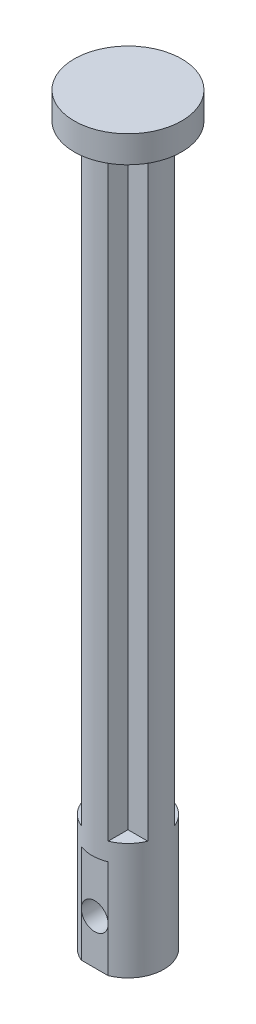
ISO-10303-21;
HEADER;
FILE_DESCRIPTION(('STEP AP214'),'2;1');
FILE_NAME('part.step','',(''),(''),'','','');
FILE_SCHEMA(('AUTOMOTIVE_DESIGN { 1 0 10303 214 1 1 1 1 }'));
ENDSEC;
DATA;
#1=APPLICATION_CONTEXT('core data for automotive mechanical design processes');
#2=APPLICATION_PROTOCOL_DEFINITION('international standard','automotive_design',2000,#1);
#3=PRODUCT_CONTEXT('',#1,'mechanical');
#4=PRODUCT('Part','Part','',(#3));
#5=PRODUCT_RELATED_PRODUCT_CATEGORY('part','',(#4));
#6=PRODUCT_DEFINITION_FORMATION('','',#4);
#7=PRODUCT_DEFINITION_CONTEXT('part definition',#1,'design');
#8=PRODUCT_DEFINITION('design','',#6,#7);
#9=PRODUCT_DEFINITION_SHAPE('','',#8);
#10=(LENGTH_UNIT() NAMED_UNIT(*) SI_UNIT(.MILLI.,.METRE.));
#11=(NAMED_UNIT(*) PLANE_ANGLE_UNIT() SI_UNIT($,.RADIAN.));
#12=(NAMED_UNIT(*) SI_UNIT($,.STERADIAN.) SOLID_ANGLE_UNIT());
#13=UNCERTAINTY_MEASURE_WITH_UNIT(LENGTH_MEASURE(1.E-05),#10,'distance_accuracy_value','');
#14=(GEOMETRIC_REPRESENTATION_CONTEXT(3) GLOBAL_UNCERTAINTY_ASSIGNED_CONTEXT((#13)) GLOBAL_UNIT_ASSIGNED_CONTEXT((#10,
#11,#12)) REPRESENTATION_CONTEXT('',''));
#15=CARTESIAN_POINT('',(0.,0.,0.));
#16=DIRECTION('',(0.,0.,1.));
#17=DIRECTION('',(1.,0.,0.));
#18=AXIS2_PLACEMENT_3D('',#15,#16,#17);
#19=CARTESIAN_POINT('',(-1.5,11.,3.70809924354783));
#20=DIRECTION('',(0.,0.,-1.));
#21=DIRECTION('',(-1.,0.,0.));
#22=AXIS2_PLACEMENT_3D('',#19,#20,#21);
#23=PLANE('',#22);
#24=DIRECTION('',(0.,-1.,0.));
#25=VECTOR('',#24,1.);
#26=CARTESIAN_POINT('',(-1.5,11.,3.70809924354783));
#27=LINE('',#26,#25);
#28=CARTESIAN_POINT('',(-1.5,11.,3.70809924354783));
#29=VERTEX_POINT('',#28);
#30=CARTESIAN_POINT('',(-1.5,5.,3.70809924354783));
#31=VERTEX_POINT('',#30);
#32=EDGE_CURVE('E193',#29,#31,#27,.T.);
#33=ORIENTED_EDGE('',*,*,#32,.T.);
#34=CARTESIAN_POINT('',(0.,5.,3.70809924354783));
#35=DIRECTION('',(0.,0.,1.));
#36=DIRECTION('',(1.,0.,0.));
#37=AXIS2_PLACEMENT_3D('',#34,#35,#36);
#38=CIRCLE('',#37,1.5);
#39=CARTESIAN_POINT('',(1.5,5.,3.70809924354783));
#40=VERTEX_POINT('',#39);
#41=EDGE_CURVE('E219',#40,#31,#38,.T.);
#42=ORIENTED_EDGE('',*,*,#41,.F.);
#43=DIRECTION('',(0.,-1.,0.));
#44=VECTOR('',#43,1.);
#45=CARTESIAN_POINT('',(1.5,11.,3.70809924354783));
#46=LINE('',#45,#44);
#47=CARTESIAN_POINT('',(1.5,11.,3.70809924354783));
#48=VERTEX_POINT('',#47);
#49=EDGE_CURVE('E197',#48,#40,#46,.T.);
#50=ORIENTED_EDGE('',*,*,#49,.F.);
#51=DIRECTION('',(1.,0.,0.));
#52=VECTOR('',#51,1.);
#53=CARTESIAN_POINT('',(-1.5,11.,3.70809924354783));
#54=LINE('',#53,#52);
#55=EDGE_CURVE('E212',#29,#48,#54,.T.);
#56=ORIENTED_EDGE('',*,*,#55,.F.);
#57=EDGE_LOOP('',(#33,#42,#50,#56));
#58=FACE_BOUND('',#57,.T.);
#59=ADVANCED_FACE('F43',(#58),#23,.F.);
#60=CARTESIAN_POINT('',(0.,80.,0.));
#61=DIRECTION('',(0.,-1.,0.));
#62=DIRECTION('',(0.,0.,-1.));
#63=AXIS2_PLACEMENT_3D('',#60,#61,#62);
#64=CYLINDRICAL_SURFACE('',#63,4.);
#65=CARTESIAN_POINT('',(0.,13.,0.));
#66=DIRECTION('',(0.,1.,0.));
#67=DIRECTION('',(0.,0.,1.));
#68=AXIS2_PLACEMENT_3D('',#65,#66,#67);
#69=CIRCLE('',#68,4.);
#70=CARTESIAN_POINT('',(-1.5,13.,-3.70809924354783));
#71=VERTEX_POINT('',#70);
#72=CARTESIAN_POINT('',(-3.70809924354783,13.,-1.5));
#73=VERTEX_POINT('',#72);
#74=EDGE_CURVE('E161',#71,#73,#69,.T.);
#75=ORIENTED_EDGE('',*,*,#74,.F.);
#76=DIRECTION('',(0.,1.,0.));
#77=VECTOR('',#76,1.);
#78=CARTESIAN_POINT('',(-1.5,13.,-3.70809924354783));
#79=LINE('',#78,#77);
#80=CARTESIAN_POINT('',(-1.5,80.,-3.70809924354783));
#81=VERTEX_POINT('',#80);
#82=EDGE_CURVE('E153',#71,#81,#79,.T.);
#83=ORIENTED_EDGE('',*,*,#82,.T.);
#84=CARTESIAN_POINT('',(0.,80.,0.));
#85=DIRECTION('',(0.,1.,0.));
#86=DIRECTION('',(0.,0.,1.));
#87=AXIS2_PLACEMENT_3D('',#84,#85,#86);
#88=CIRCLE('',#87,4.);
#89=CARTESIAN_POINT('',(1.5,80.,-3.70809924354783));
#90=VERTEX_POINT('',#89);
#91=EDGE_CURVE('E158',#90,#81,#88,.T.);
#92=ORIENTED_EDGE('',*,*,#91,.F.);
#93=DIRECTION('',(0.,1.,0.));
#94=VECTOR('',#93,1.);
#95=CARTESIAN_POINT('',(1.5,13.,-3.70809924354783));
#96=LINE('',#95,#94);
#97=CARTESIAN_POINT('',(1.5,13.,-3.70809924354783));
#98=VERTEX_POINT('',#97);
#99=EDGE_CURVE('E281',#98,#90,#96,.T.);
#100=ORIENTED_EDGE('',*,*,#99,.F.);
#101=CARTESIAN_POINT('',(0.,13.,0.));
#102=DIRECTION('',(0.,1.,0.));
#103=DIRECTION('',(0.,0.,1.));
#104=AXIS2_PLACEMENT_3D('',#101,#102,#103);
#105=CIRCLE('',#104,4.);
#106=CARTESIAN_POINT('',(3.70809924354783,13.,-1.5));
#107=VERTEX_POINT('',#106);
#108=EDGE_CURVE('E268',#107,#98,#105,.T.);
#109=ORIENTED_EDGE('',*,*,#108,.F.);
#110=DIRECTION('',(0.,1.,0.));
#111=VECTOR('',#110,1.);
#112=CARTESIAN_POINT('',(3.70809924354783,13.,-1.5));
#113=LINE('',#112,#111);
#114=CARTESIAN_POINT('',(3.70809924354783,80.,-1.5));
#115=VERTEX_POINT('',#114);
#116=EDGE_CURVE('E262',#107,#115,#113,.T.);
#117=ORIENTED_EDGE('',*,*,#116,.T.);
#118=CARTESIAN_POINT('',(3.70809924354783,80.,1.5));
#119=VERTEX_POINT('',#118);
#120=EDGE_CURVE('E52',#119,#115,#88,.T.);
#121=ORIENTED_EDGE('',*,*,#120,.F.);
#122=DIRECTION('',(0.,1.,0.));
#123=VECTOR('',#122,1.);
#124=CARTESIAN_POINT('',(3.70809924354783,13.,1.5));
#125=LINE('',#124,#123);
#126=CARTESIAN_POINT('',(3.70809924354783,13.,1.5));
#127=VERTEX_POINT('',#126);
#128=EDGE_CURVE('E308',#127,#119,#125,.T.);
#129=ORIENTED_EDGE('',*,*,#128,.F.);
#130=CARTESIAN_POINT('',(0.,13.,0.));
#131=DIRECTION('',(0.,1.,0.));
#132=DIRECTION('',(0.,0.,1.));
#133=AXIS2_PLACEMENT_3D('',#130,#131,#132);
#134=CIRCLE('',#133,4.);
#135=CARTESIAN_POINT('',(1.5,13.,3.70809924354783));
#136=VERTEX_POINT('',#135);
#137=EDGE_CURVE('E295',#136,#127,#134,.T.);
#138=ORIENTED_EDGE('',*,*,#137,.F.);
#139=DIRECTION('',(0.,1.,0.));
#140=VECTOR('',#139,1.);
#141=CARTESIAN_POINT('',(1.5,13.,3.70809924354783));
#142=LINE('',#141,#140);
#143=CARTESIAN_POINT('',(1.5,80.,3.70809924354783));
#144=VERTEX_POINT('',#143);
#145=EDGE_CURVE('E284',#136,#144,#142,.T.);
#146=ORIENTED_EDGE('',*,*,#145,.T.);
#147=CARTESIAN_POINT('',(-1.5,80.,3.70809924354783));
#148=VERTEX_POINT('',#147);
#149=EDGE_CURVE('E187',#148,#144,#88,.T.);
#150=ORIENTED_EDGE('',*,*,#149,.F.);
#151=DIRECTION('',(0.,1.,0.));
#152=VECTOR('',#151,1.);
#153=CARTESIAN_POINT('',(-1.5,13.,3.70809924354783));
#154=LINE('',#153,#152);
#155=CARTESIAN_POINT('',(-1.5,13.,3.70809924354783));
#156=VERTEX_POINT('',#155);
#157=EDGE_CURVE('E59',#156,#148,#154,.T.);
#158=ORIENTED_EDGE('',*,*,#157,.F.);
#159=CARTESIAN_POINT('',(0.,13.,0.));
#160=DIRECTION('',(0.,1.,0.));
#161=DIRECTION('',(0.,0.,1.));
#162=AXIS2_PLACEMENT_3D('',#159,#160,#161);
#163=CIRCLE('',#162,4.);
#164=CARTESIAN_POINT('',(-3.70809924354783,13.,1.5));
#165=VERTEX_POINT('',#164);
#166=EDGE_CURVE('E238',#165,#156,#163,.T.);
#167=ORIENTED_EDGE('',*,*,#166,.F.);
#168=DIRECTION('',(0.,1.,0.));
#169=VECTOR('',#168,1.);
#170=CARTESIAN_POINT('',(-3.70809924354783,13.,1.5));
#171=LINE('',#170,#169);
#172=CARTESIAN_POINT('',(-3.70809924354783,80.,1.5));
#173=VERTEX_POINT('',#172);
#174=EDGE_CURVE('E222',#165,#173,#171,.T.);
#175=ORIENTED_EDGE('',*,*,#174,.T.);
#176=CARTESIAN_POINT('',(-3.70809924354783,80.,-1.5));
#177=VERTEX_POINT('',#176);
#178=EDGE_CURVE('E182',#177,#173,#88,.T.);
#179=ORIENTED_EDGE('',*,*,#178,.F.);
#180=DIRECTION('',(0.,1.,0.));
#181=VECTOR('',#180,1.);
#182=CARTESIAN_POINT('',(-3.70809924354783,13.,-1.5));
#183=LINE('',#182,#181);
#184=EDGE_CURVE('E67',#73,#177,#183,.T.);
#185=ORIENTED_EDGE('',*,*,#184,.F.);
#186=EDGE_LOOP('',(#75,#83,#92,#100,#109,#117,#121,#129,#138,#146,#150,#158,#167,#175,#179,#185));
#187=FACE_BOUND('',#186,.T.);
#188=CARTESIAN_POINT('',(0.,11.,0.));
#189=DIRECTION('',(0.,-1.,0.));
#190=DIRECTION('',(0.,0.,-1.));
#191=AXIS2_PLACEMENT_3D('',#188,#189,#190);
#192=CIRCLE('',#191,4.);
#193=EDGE_CURVE('E210',#48,#29,#192,.T.);
#194=ORIENTED_EDGE('',*,*,#193,.F.);
#195=ORIENTED_EDGE('',*,*,#49,.T.);
#196=CARTESIAN_POINT('',(1.5,0.,3.70809924354783));
#197=VERTEX_POINT('',#196);
#198=EDGE_CURVE('E202',#40,#197,#46,.T.);
#199=ORIENTED_EDGE('',*,*,#198,.T.);
#200=CARTESIAN_POINT('',(0.,0.,0.));
#201=DIRECTION('',(0.,1.,0.));
#202=DIRECTION('',(0.,0.,1.));
#203=AXIS2_PLACEMENT_3D('',#200,#201,#202);
#204=CIRCLE('',#203,4.);
#205=CARTESIAN_POINT('',(-1.5,0.,3.70809924354783));
#206=VERTEX_POINT('',#205);
#207=EDGE_CURVE('E192',#197,#206,#204,.T.);
#208=ORIENTED_EDGE('',*,*,#207,.T.);
#209=EDGE_CURVE('E216',#31,#206,#27,.T.);
#210=ORIENTED_EDGE('',*,*,#209,.F.);
#211=ORIENTED_EDGE('',*,*,#32,.F.);
#212=EDGE_LOOP('',(#194,#195,#199,#208,#210,#211));
#213=FACE_BOUND('',#212,.T.);
#214=ADVANCED_FACE('F45',(#187,#213),#64,.T.);
#215=CARTESIAN_POINT('',(0.,0.,0.));
#216=DIRECTION('',(0.,1.,0.));
#217=DIRECTION('',(0.,0.,1.));
#218=AXIS2_PLACEMENT_3D('',#215,#216,#217);
#219=PLANE('',#218);
#220=ORIENTED_EDGE('',*,*,#207,.F.);
#221=DIRECTION('',(1.,0.,0.));
#222=VECTOR('',#221,1.);
#223=CARTESIAN_POINT('',(-1.5,0.,3.70809924354783));
#224=LINE('',#223,#222);
#225=EDGE_CURVE('E206',#206,#197,#224,.T.);
#226=ORIENTED_EDGE('',*,*,#225,.F.);
#227=EDGE_LOOP('',(#220,#226));
#228=FACE_BOUND('',#227,.T.);
#229=ADVANCED_FACE('F355',(#228),#219,.F.);
#230=ORIENTED_EDGE('',*,*,#198,.F.);
#231=CARTESIAN_POINT('',(0.,5.,3.70809924354783));
#232=DIRECTION('',(0.,0.,-1.));
#233=DIRECTION('',(-1.,0.,0.));
#234=AXIS2_PLACEMENT_3D('',#231,#232,#233);
#235=CIRCLE('',#234,1.5);
#236=EDGE_CURVE('E11',#40,#31,#235,.T.);
#237=ORIENTED_EDGE('',*,*,#236,.T.);
#238=ORIENTED_EDGE('',*,*,#209,.T.);
#239=ORIENTED_EDGE('',*,*,#225,.T.);
#240=EDGE_LOOP('',(#230,#237,#238,#239));
#241=FACE_BOUND('',#240,.T.);
#242=ADVANCED_FACE('F351',(#241),#23,.F.);
#243=CARTESIAN_POINT('',(0.,11.,0.));
#244=DIRECTION('',(0.,-1.,0.));
#245=DIRECTION('',(0.,0.,-1.));
#246=AXIS2_PLACEMENT_3D('',#243,#244,#245);
#247=PLANE('',#246);
#248=ORIENTED_EDGE('',*,*,#193,.T.);
#249=ORIENTED_EDGE('',*,*,#55,.T.);
#250=EDGE_LOOP('',(#248,#249));
#251=FACE_BOUND('',#250,.T.);
#252=ADVANCED_FACE('F359',(#251),#247,.T.);
#253=CARTESIAN_POINT('',(0.,5.,-0.291900756452169));
#254=DIRECTION('',(0.,0.,1.));
#255=DIRECTION('',(1.,0.,0.));
#256=AXIS2_PLACEMENT_3D('',#253,#254,#255);
#257=CYLINDRICAL_SURFACE('',#256,1.5);
#258=CARTESIAN_POINT('',(0.,5.,-0.291900756452169));
#259=DIRECTION('',(0.,0.,1.));
#260=DIRECTION('',(1.,0.,0.));
#261=AXIS2_PLACEMENT_3D('',#258,#259,#260);
#262=CIRCLE('',#261,1.5);
#263=CARTESIAN_POINT('',(1.5,5.,-0.291900756452169));
#264=VERTEX_POINT('',#263);
#265=EDGE_CURVE('E211',#264,#264,#262,.T.);
#266=ORIENTED_EDGE('',*,*,#265,.F.);
#267=EDGE_LOOP('',(#266));
#268=FACE_BOUND('',#267,.T.);
#269=ORIENTED_EDGE('',*,*,#41,.T.);
#270=ORIENTED_EDGE('',*,*,#236,.F.);
#271=EDGE_LOOP('',(#269,#270));
#272=FACE_BOUND('',#271,.T.);
#273=ADVANCED_FACE('F365',(#268,#272),#257,.F.);
#274=CARTESIAN_POINT('',(0.,5.,-0.291900756452169));
#275=DIRECTION('',(0.,0.,1.));
#276=DIRECTION('',(1.,0.,0.));
#277=AXIS2_PLACEMENT_3D('',#274,#275,#276);
#278=PLANE('',#277);
#279=ORIENTED_EDGE('',*,*,#265,.T.);
#280=EDGE_LOOP('',(#279));
#281=FACE_BOUND('',#280,.T.);
#282=ADVANCED_FACE('F375',(#281),#278,.T.);
#283=CARTESIAN_POINT('',(-3.70809924354783,13.,1.5));
#284=DIRECTION('',(0.,0.,-1.));
#285=DIRECTION('',(-1.,0.,0.));
#286=AXIS2_PLACEMENT_3D('',#283,#284,#285);
#287=PLANE('',#286);
#288=DIRECTION('',(-1.,0.,0.));
#289=VECTOR('',#288,1.);
#290=CARTESIAN_POINT('',(-3.70809924354783,80.,1.5));
#291=LINE('',#290,#289);
#292=CARTESIAN_POINT('',(-1.5,80.,1.5));
#293=VERTEX_POINT('',#292);
#294=EDGE_CURVE('E235',#293,#173,#291,.T.);
#295=ORIENTED_EDGE('',*,*,#294,.T.);
#296=ORIENTED_EDGE('',*,*,#174,.F.);
#297=DIRECTION('',(-1.,0.,0.));
#298=VECTOR('',#297,1.);
#299=CARTESIAN_POINT('',(-3.70809924354783,13.,1.5));
#300=LINE('',#299,#298);
#301=CARTESIAN_POINT('',(-1.5,13.,1.5));
#302=VERTEX_POINT('',#301);
#303=EDGE_CURVE('E229',#302,#165,#300,.T.);
#304=ORIENTED_EDGE('',*,*,#303,.F.);
#305=DIRECTION('',(0.,1.,0.));
#306=VECTOR('',#305,1.);
#307=CARTESIAN_POINT('',(-1.5,13.,1.5));
#308=LINE('',#307,#306);
#309=EDGE_CURVE('E228',#302,#293,#308,.T.);
#310=ORIENTED_EDGE('',*,*,#309,.T.);
#311=EDGE_LOOP('',(#295,#296,#304,#310));
#312=FACE_BOUND('',#311,.T.);
#313=ADVANCED_FACE('F381',(#312),#287,.F.);
#314=CARTESIAN_POINT('',(-1.5,13.,1.5));
#315=DIRECTION('',(1.,0.,0.));
#316=DIRECTION('',(0.,0.,-1.));
#317=AXIS2_PLACEMENT_3D('',#314,#315,#316);
#318=PLANE('',#317);
#319=DIRECTION('',(0.,0.,-1.));
#320=VECTOR('',#319,1.);
#321=CARTESIAN_POINT('',(-1.5,80.,1.5));
#322=LINE('',#321,#320);
#323=EDGE_CURVE('E239',#148,#293,#322,.T.);
#324=ORIENTED_EDGE('',*,*,#323,.T.);
#325=ORIENTED_EDGE('',*,*,#309,.F.);
#326=DIRECTION('',(0.,0.,-1.));
#327=VECTOR('',#326,1.);
#328=CARTESIAN_POINT('',(-1.5,13.,3.58639793762953));
#329=LINE('',#328,#327);
#330=EDGE_CURVE('E246',#156,#302,#329,.T.);
#331=ORIENTED_EDGE('',*,*,#330,.F.);
#332=ORIENTED_EDGE('',*,*,#157,.T.);
#333=EDGE_LOOP('',(#324,#325,#331,#332));
#334=FACE_BOUND('',#333,.T.);
#335=ADVANCED_FACE('F386',(#334),#318,.F.);
#336=CARTESIAN_POINT('',(0.,13.,0.));
#337=DIRECTION('',(0.,1.,0.));
#338=DIRECTION('',(0.,0.,1.));
#339=AXIS2_PLACEMENT_3D('',#336,#337,#338);
#340=PLANE('',#339);
#341=ORIENTED_EDGE('',*,*,#166,.T.);
#342=ORIENTED_EDGE('',*,*,#330,.T.);
#343=ORIENTED_EDGE('',*,*,#303,.T.);
#344=EDGE_LOOP('',(#341,#342,#343));
#345=FACE_BOUND('',#344,.T.);
#346=ADVANCED_FACE('F389',(#345),#340,.T.);
#347=CARTESIAN_POINT('',(1.5,13.,3.70809924354783));
#348=DIRECTION('',(-1.,0.,0.));
#349=DIRECTION('',(0.,0.,1.));
#350=AXIS2_PLACEMENT_3D('',#347,#348,#349);
#351=PLANE('',#350);
#352=DIRECTION('',(0.,0.,1.));
#353=VECTOR('',#352,1.);
#354=CARTESIAN_POINT('',(1.5,80.,3.70809924354783));
#355=LINE('',#354,#353);
#356=CARTESIAN_POINT('',(1.5,80.,1.5));
#357=VERTEX_POINT('',#356);
#358=EDGE_CURVE('E299',#357,#144,#355,.T.);
#359=ORIENTED_EDGE('',*,*,#358,.T.);
#360=ORIENTED_EDGE('',*,*,#145,.F.);
#361=DIRECTION('',(0.,0.,1.));
#362=VECTOR('',#361,1.);
#363=CARTESIAN_POINT('',(1.5,13.,3.70809924354783));
#364=LINE('',#363,#362);
#365=CARTESIAN_POINT('',(1.5,13.,1.5));
#366=VERTEX_POINT('',#365);
#367=EDGE_CURVE('E304',#366,#136,#364,.T.);
#368=ORIENTED_EDGE('',*,*,#367,.F.);
#369=DIRECTION('',(0.,1.,0.));
#370=VECTOR('',#369,1.);
#371=CARTESIAN_POINT('',(1.5,13.,1.5));
#372=LINE('',#371,#370);
#373=EDGE_CURVE('E317',#366,#357,#372,.T.);
#374=ORIENTED_EDGE('',*,*,#373,.T.);
#375=EDGE_LOOP('',(#359,#360,#368,#374));
#376=FACE_BOUND('',#375,.T.);
#377=ADVANCED_FACE('F394',(#376),#351,.F.);
#378=CARTESIAN_POINT('',(1.5,13.,1.5));
#379=DIRECTION('',(0.,0.,-1.));
#380=DIRECTION('',(-1.,0.,0.));
#381=AXIS2_PLACEMENT_3D('',#378,#379,#380);
#382=PLANE('',#381);
#383=DIRECTION('',(-1.,0.,0.));
#384=VECTOR('',#383,1.);
#385=CARTESIAN_POINT('',(1.5,80.,1.5));
#386=LINE('',#385,#384);
#387=EDGE_CURVE('E242',#119,#357,#386,.T.);
#388=ORIENTED_EDGE('',*,*,#387,.T.);
#389=ORIENTED_EDGE('',*,*,#373,.F.);
#390=DIRECTION('',(-1.,0.,0.));
#391=VECTOR('',#390,1.);
#392=CARTESIAN_POINT('',(1.5,13.,1.5));
#393=LINE('',#392,#391);
#394=EDGE_CURVE('E300',#127,#366,#393,.T.);
#395=ORIENTED_EDGE('',*,*,#394,.F.);
#396=ORIENTED_EDGE('',*,*,#128,.T.);
#397=EDGE_LOOP('',(#388,#389,#395,#396));
#398=FACE_BOUND('',#397,.T.);
#399=ADVANCED_FACE('F416',(#398),#382,.F.);
#400=CARTESIAN_POINT('',(0.,13.,0.));
#401=DIRECTION('',(0.,1.,0.));
#402=DIRECTION('',(0.,0.,1.));
#403=AXIS2_PLACEMENT_3D('',#400,#401,#402);
#404=PLANE('',#403);
#405=ORIENTED_EDGE('',*,*,#137,.T.);
#406=ORIENTED_EDGE('',*,*,#394,.T.);
#407=ORIENTED_EDGE('',*,*,#367,.T.);
#408=EDGE_LOOP('',(#405,#406,#407));
#409=FACE_BOUND('',#408,.T.);
#410=ADVANCED_FACE('F409',(#409),#404,.T.);
#411=CARTESIAN_POINT('',(1.5,13.,-1.5));
#412=DIRECTION('',(0.,0.,1.));
#413=DIRECTION('',(1.,0.,0.));
#414=AXIS2_PLACEMENT_3D('',#411,#412,#413);
#415=PLANE('',#414);
#416=DIRECTION('',(1.,0.,0.));
#417=VECTOR('',#416,1.);
#418=CARTESIAN_POINT('',(1.5,80.,-1.5));
#419=LINE('',#418,#417);
#420=CARTESIAN_POINT('',(1.5,80.,-1.5));
#421=VERTEX_POINT('',#420);
#422=EDGE_CURVE('E272',#421,#115,#419,.T.);
#423=ORIENTED_EDGE('',*,*,#422,.T.);
#424=ORIENTED_EDGE('',*,*,#116,.F.);
#425=DIRECTION('',(1.,0.,0.));
#426=VECTOR('',#425,1.);
#427=CARTESIAN_POINT('',(1.5,13.,-1.5));
#428=LINE('',#427,#426);
#429=CARTESIAN_POINT('',(1.5,13.,-1.5));
#430=VERTEX_POINT('',#429);
#431=EDGE_CURVE('E277',#430,#107,#428,.T.);
#432=ORIENTED_EDGE('',*,*,#431,.F.);
#433=DIRECTION('',(0.,1.,0.));
#434=VECTOR('',#433,1.);
#435=CARTESIAN_POINT('',(1.5,13.,-1.5));
#436=LINE('',#435,#434);
#437=EDGE_CURVE('E290',#430,#421,#436,.T.);
#438=ORIENTED_EDGE('',*,*,#437,.T.);
#439=EDGE_LOOP('',(#423,#424,#432,#438));
#440=FACE_BOUND('',#439,.T.);
#441=ADVANCED_FACE('F406',(#440),#415,.F.);
#442=CARTESIAN_POINT('',(1.5,13.,-3.70809924354783));
#443=DIRECTION('',(-1.,0.,0.));
#444=DIRECTION('',(0.,0.,1.));
#445=AXIS2_PLACEMENT_3D('',#442,#443,#444);
#446=PLANE('',#445);
#447=DIRECTION('',(0.,0.,1.));
#448=VECTOR('',#447,1.);
#449=CARTESIAN_POINT('',(1.5,80.,-3.70809924354783));
#450=LINE('',#449,#448);
#451=EDGE_CURVE('E180',#90,#421,#450,.T.);
#452=ORIENTED_EDGE('',*,*,#451,.T.);
#453=ORIENTED_EDGE('',*,*,#437,.F.);
#454=DIRECTION('',(0.,0.,1.));
#455=VECTOR('',#454,1.);
#456=CARTESIAN_POINT('',(1.5,13.,-3.70809924354783));
#457=LINE('',#456,#455);
#458=EDGE_CURVE('E273',#98,#430,#457,.T.);
#459=ORIENTED_EDGE('',*,*,#458,.F.);
#460=ORIENTED_EDGE('',*,*,#99,.T.);
#461=EDGE_LOOP('',(#452,#453,#459,#460));
#462=FACE_BOUND('',#461,.T.);
#463=ADVANCED_FACE('F404',(#462),#446,.F.);
#464=CARTESIAN_POINT('',(0.,13.,0.));
#465=DIRECTION('',(0.,1.,0.));
#466=DIRECTION('',(0.,0.,1.));
#467=AXIS2_PLACEMENT_3D('',#464,#465,#466);
#468=PLANE('',#467);
#469=ORIENTED_EDGE('',*,*,#108,.T.);
#470=ORIENTED_EDGE('',*,*,#458,.T.);
#471=ORIENTED_EDGE('',*,*,#431,.T.);
#472=EDGE_LOOP('',(#469,#470,#471));
#473=FACE_BOUND('',#472,.T.);
#474=ADVANCED_FACE('F399',(#473),#468,.T.);
#475=CARTESIAN_POINT('',(-1.5,13.,-1.5));
#476=DIRECTION('',(1.,0.,0.));
#477=DIRECTION('',(0.,0.,-1.));
#478=AXIS2_PLACEMENT_3D('',#475,#476,#477);
#479=PLANE('',#478);
#480=DIRECTION('',(0.,0.,-1.));
#481=VECTOR('',#480,1.);
#482=CARTESIAN_POINT('',(-1.5,80.,-1.5));
#483=LINE('',#482,#481);
#484=CARTESIAN_POINT('',(-1.5,80.,-1.5));
#485=VERTEX_POINT('',#484);
#486=EDGE_CURVE('E170',#485,#81,#483,.T.);
#487=ORIENTED_EDGE('',*,*,#486,.T.);
#488=ORIENTED_EDGE('',*,*,#82,.F.);
#489=DIRECTION('',(0.,0.,-1.));
#490=VECTOR('',#489,1.);
#491=CARTESIAN_POINT('',(-1.5,13.,-1.5));
#492=LINE('',#491,#490);
#493=CARTESIAN_POINT('',(-1.5,13.,-1.5));
#494=VERTEX_POINT('',#493);
#495=EDGE_CURVE('E258',#494,#71,#492,.T.);
#496=ORIENTED_EDGE('',*,*,#495,.F.);
#497=DIRECTION('',(0.,1.,0.));
#498=VECTOR('',#497,1.);
#499=CARTESIAN_POINT('',(-1.5,13.,-1.5));
#500=LINE('',#499,#498);
#501=EDGE_CURVE('E166',#494,#485,#500,.T.);
#502=ORIENTED_EDGE('',*,*,#501,.T.);
#503=EDGE_LOOP('',(#487,#488,#496,#502));
#504=FACE_BOUND('',#503,.T.);
#505=ADVANCED_FACE('F171',(#504),#479,.F.);
#506=CARTESIAN_POINT('',(-3.70809924354783,13.,-1.5));
#507=DIRECTION('',(0.,0.,1.));
#508=DIRECTION('',(1.,0.,0.));
#509=AXIS2_PLACEMENT_3D('',#506,#507,#508);
#510=PLANE('',#509);
#511=DIRECTION('',(1.,0.,0.));
#512=VECTOR('',#511,1.);
#513=CARTESIAN_POINT('',(-3.70809924354783,80.,-1.5));
#514=LINE('',#513,#512);
#515=EDGE_CURVE('E175',#177,#485,#514,.T.);
#516=ORIENTED_EDGE('',*,*,#515,.T.);
#517=ORIENTED_EDGE('',*,*,#501,.F.);
#518=DIRECTION('',(1.,0.,0.));
#519=VECTOR('',#518,1.);
#520=CARTESIAN_POINT('',(-3.70809924354783,13.,-1.5));
#521=LINE('',#520,#519);
#522=EDGE_CURVE('E254',#73,#494,#521,.T.);
#523=ORIENTED_EDGE('',*,*,#522,.F.);
#524=ORIENTED_EDGE('',*,*,#184,.T.);
#525=EDGE_LOOP('',(#516,#517,#523,#524));
#526=FACE_BOUND('',#525,.T.);
#527=ADVANCED_FACE('F344',(#526),#510,.F.);
#528=CARTESIAN_POINT('',(0.,13.,0.));
#529=DIRECTION('',(0.,1.,0.));
#530=DIRECTION('',(0.,0.,1.));
#531=AXIS2_PLACEMENT_3D('',#528,#529,#530);
#532=PLANE('',#531);
#533=ORIENTED_EDGE('',*,*,#74,.T.);
#534=ORIENTED_EDGE('',*,*,#522,.T.);
#535=ORIENTED_EDGE('',*,*,#495,.T.);
#536=EDGE_LOOP('',(#533,#534,#535));
#537=FACE_BOUND('',#536,.T.);
#538=ADVANCED_FACE('F339',(#537),#532,.T.);
#539=CARTESIAN_POINT('',(0.,80.,0.));
#540=DIRECTION('',(0.,1.,0.));
#541=DIRECTION('',(0.,0.,1.));
#542=AXIS2_PLACEMENT_3D('',#539,#540,#541);
#543=PLANE('',#542);
#544=CARTESIAN_POINT('',(0.,80.,0.));
#545=DIRECTION('',(0.,1.,0.));
#546=DIRECTION('',(0.,0.,1.));
#547=AXIS2_PLACEMENT_3D('',#544,#545,#546);
#548=CIRCLE('',#547,6.);
#549=CARTESIAN_POINT('',(0.,80.,6.));
#550=VERTEX_POINT('',#549);
#551=EDGE_CURVE('E322',#550,#550,#548,.T.);
#552=ORIENTED_EDGE('',*,*,#551,.F.);
#553=EDGE_LOOP('',(#552));
#554=FACE_BOUND('',#553,.T.);
#555=ORIENTED_EDGE('',*,*,#486,.F.);
#556=ORIENTED_EDGE('',*,*,#515,.F.);
#557=ORIENTED_EDGE('',*,*,#178,.T.);
#558=ORIENTED_EDGE('',*,*,#294,.F.);
#559=ORIENTED_EDGE('',*,*,#323,.F.);
#560=ORIENTED_EDGE('',*,*,#149,.T.);
#561=ORIENTED_EDGE('',*,*,#358,.F.);
#562=ORIENTED_EDGE('',*,*,#387,.F.);
#563=ORIENTED_EDGE('',*,*,#120,.T.);
#564=ORIENTED_EDGE('',*,*,#422,.F.);
#565=ORIENTED_EDGE('',*,*,#451,.F.);
#566=ORIENTED_EDGE('',*,*,#91,.T.);
#567=EDGE_LOOP('',(#555,#556,#557,#558,#559,#560,#561,#562,#563,#564,#565,#566));
#568=FACE_BOUND('',#567,.T.);
#569=ADVANCED_FACE('F177',(#554,#568),#543,.F.);
#570=CARTESIAN_POINT('',(0.,83.,0.));
#571=DIRECTION('',(0.,-1.,0.));
#572=DIRECTION('',(0.,0.,-1.));
#573=AXIS2_PLACEMENT_3D('',#570,#571,#572);
#574=CYLINDRICAL_SURFACE('',#573,6.);
#575=CARTESIAN_POINT('',(0.,83.,0.));
#576=DIRECTION('',(0.,1.,0.));
#577=DIRECTION('',(0.,0.,1.));
#578=AXIS2_PLACEMENT_3D('',#575,#576,#577);
#579=CIRCLE('',#578,6.);
#580=CARTESIAN_POINT('',(0.,83.,6.));
#581=VERTEX_POINT('',#580);
#582=EDGE_CURVE('E167',#581,#581,#579,.T.);
#583=ORIENTED_EDGE('',*,*,#582,.F.);
#584=EDGE_LOOP('',(#583));
#585=FACE_BOUND('',#584,.T.);
#586=ORIENTED_EDGE('',*,*,#551,.T.);
#587=EDGE_LOOP('',(#586));
#588=FACE_BOUND('',#587,.T.);
#589=ADVANCED_FACE('F332',(#585,#588),#574,.T.);
#590=CARTESIAN_POINT('',(0.,83.,0.));
#591=DIRECTION('',(0.,1.,0.));
#592=DIRECTION('',(0.,0.,1.));
#593=AXIS2_PLACEMENT_3D('',#590,#591,#592);
#594=PLANE('',#593);
#595=ORIENTED_EDGE('',*,*,#582,.T.);
#596=EDGE_LOOP('',(#595));
#597=FACE_BOUND('',#596,.T.);
#598=ADVANCED_FACE('F330',(#597),#594,.T.);
#599=CLOSED_SHELL('',(#59,#214,#229,#242,#252,#273,#282,#313,#335,#346,#377,#399,#410,#441,#463,
#474,#505,#527,#538,#569,#589,#598));
#600=MANIFOLD_SOLID_BREP('B2',#599);
#601=ADVANCED_BREP_SHAPE_REPRESENTATION('',(#18,#600),#14);
#602=SHAPE_DEFINITION_REPRESENTATION(#9,#601);
ENDSEC;
END-ISO-10303-21;
